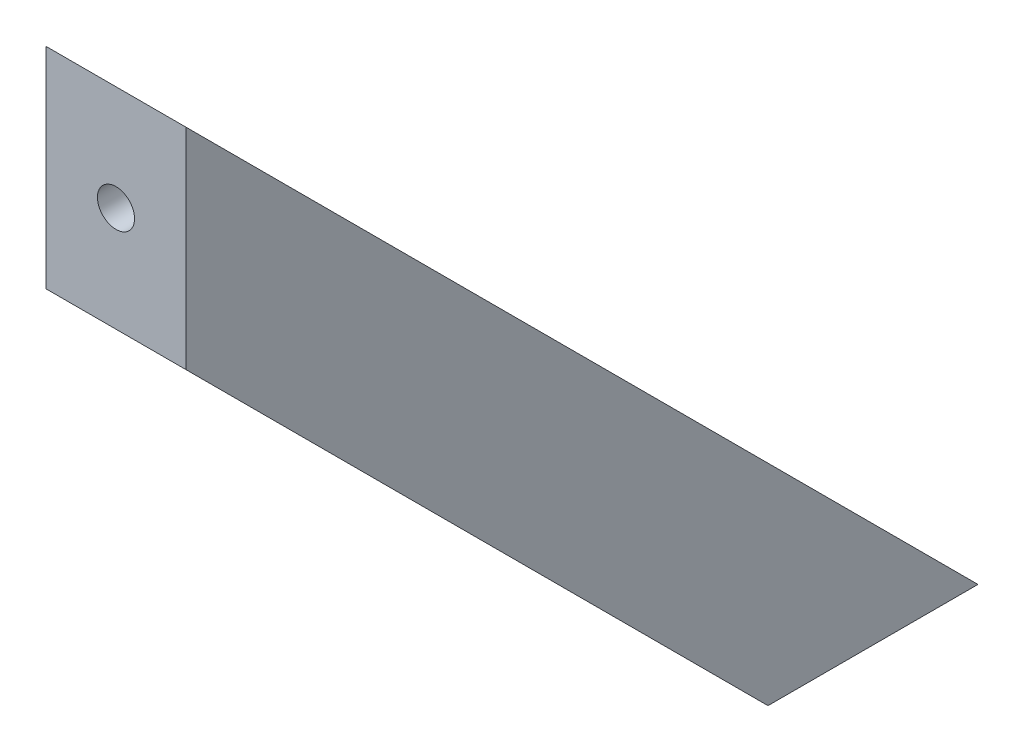
ISO-10303-21;
HEADER;
FILE_DESCRIPTION(('STEP AP214'),'2;1');
FILE_NAME('part.step','',(''),(''),'','','');
FILE_SCHEMA(('AUTOMOTIVE_DESIGN { 1 0 10303 214 1 1 1 1 }'));
ENDSEC;
DATA;
#1=APPLICATION_CONTEXT('core data for automotive mechanical design processes');
#2=APPLICATION_PROTOCOL_DEFINITION('international standard','automotive_design',2000,#1);
#3=PRODUCT_CONTEXT('',#1,'mechanical');
#4=PRODUCT('Part','Part','',(#3));
#5=PRODUCT_RELATED_PRODUCT_CATEGORY('part','',(#4));
#6=PRODUCT_DEFINITION_FORMATION('','',#4);
#7=PRODUCT_DEFINITION_CONTEXT('part definition',#1,'design');
#8=PRODUCT_DEFINITION('design','',#6,#7);
#9=PRODUCT_DEFINITION_SHAPE('','',#8);
#10=(LENGTH_UNIT() NAMED_UNIT(*) SI_UNIT(.MILLI.,.METRE.));
#11=(NAMED_UNIT(*) PLANE_ANGLE_UNIT() SI_UNIT($,.RADIAN.));
#12=(NAMED_UNIT(*) SI_UNIT($,.STERADIAN.) SOLID_ANGLE_UNIT());
#13=UNCERTAINTY_MEASURE_WITH_UNIT(LENGTH_MEASURE(1.E-05),#10,'distance_accuracy_value','');
#14=(GEOMETRIC_REPRESENTATION_CONTEXT(3) GLOBAL_UNCERTAINTY_ASSIGNED_CONTEXT((#13)) GLOBAL_UNIT_ASSIGNED_CONTEXT((#10,
#11,#12)) REPRESENTATION_CONTEXT('',''));
#15=CARTESIAN_POINT('',(0.,0.,0.));
#16=DIRECTION('',(0.,0.,1.));
#17=DIRECTION('',(1.,0.,0.));
#18=AXIS2_PLACEMENT_3D('',#15,#16,#17);
#19=CARTESIAN_POINT('',(20.,1.4137996329211E-13,-30.));
#20=DIRECTION('',(0.,1.,0.));
#21=DIRECTION('',(0.,0.,1.));
#22=AXIS2_PLACEMENT_3D('',#19,#20,#21);
#23=PLANE('',#22);
#24=CARTESIAN_POINT('',(10.,0.,-15.));
#25=DIRECTION('',(0.,-1.,0.));
#26=DIRECTION('',(0.,0.,-1.));
#27=AXIS2_PLACEMENT_3D('',#24,#25,#26);
#28=CIRCLE('',#27,2.65);
#29=CARTESIAN_POINT('',(10.,0.,-17.65));
#30=VERTEX_POINT('',#29);
#31=EDGE_CURVE('E101',#30,#30,#28,.T.);
#32=ORIENTED_EDGE('',*,*,#31,.F.);
#33=EDGE_LOOP('',(#32));
#34=FACE_BOUND('',#33,.T.);
#35=DIRECTION('',(0.,0.,-1.));
#36=VECTOR('',#35,1.);
#37=CARTESIAN_POINT('',(0.,1.4137996329211E-13,-30.));
#38=LINE('',#37,#36);
#39=CARTESIAN_POINT('',(0.,0.,0.));
#40=VERTEX_POINT('',#39);
#41=CARTESIAN_POINT('',(0.,1.4137996329211E-13,-30.));
#42=VERTEX_POINT('',#41);
#43=EDGE_CURVE('E98',#40,#42,#38,.T.);
#44=ORIENTED_EDGE('',*,*,#43,.T.);
#45=DIRECTION('',(-1.,0.,0.));
#46=VECTOR('',#45,1.);
#47=CARTESIAN_POINT('',(20.,1.4137996329211E-13,-30.));
#48=LINE('',#47,#46);
#49=CARTESIAN_POINT('',(20.,1.4137996329211E-13,-30.));
#50=VERTEX_POINT('',#49);
#51=EDGE_CURVE('E11',#50,#42,#48,.T.);
#52=ORIENTED_EDGE('',*,*,#51,.F.);
#53=DIRECTION('',(0.,0.,-1.));
#54=VECTOR('',#53,1.);
#55=CARTESIAN_POINT('',(20.,1.4137996329211E-13,-30.));
#56=LINE('',#55,#54);
#57=CARTESIAN_POINT('',(20.,0.,0.));
#58=VERTEX_POINT('',#57);
#59=EDGE_CURVE('E85',#58,#50,#56,.T.);
#60=ORIENTED_EDGE('',*,*,#59,.F.);
#61=DIRECTION('',(-1.,0.,0.));
#62=VECTOR('',#61,1.);
#63=CARTESIAN_POINT('',(20.,0.,0.));
#64=LINE('',#63,#62);
#65=EDGE_CURVE('E94',#58,#40,#64,.T.);
#66=ORIENTED_EDGE('',*,*,#65,.T.);
#67=EDGE_LOOP('',(#44,#52,#60,#66));
#68=FACE_BOUND('',#67,.T.);
#69=ADVANCED_FACE('F32',(#34,#68),#23,.F.);
#70=CARTESIAN_POINT('',(20.,113.137084989848,83.1370849898479));
#71=DIRECTION('',(0.,-0.707106781186549,0.707106781186546));
#72=DIRECTION('',(0.,-0.707106781186546,-0.707106781186549));
#73=AXIS2_PLACEMENT_3D('',#70,#71,#72);
#74=PLANE('',#73);
#75=CARTESIAN_POINT('',(10.,15.0000000000002,-14.9999999999999));
#76=DIRECTION('',(0.,-0.707106781186549,0.707106781186546));
#77=DIRECTION('',(0.,-0.707106781186546,-0.707106781186549));
#78=AXIS2_PLACEMENT_3D('',#75,#76,#77);
#79=ELLIPSE('',#78,7.77817459305204,5.5);
#80=CARTESIAN_POINT('',(10.,9.50000000000017,-20.5));
#81=VERTEX_POINT('',#80);
#82=EDGE_CURVE('E35',#81,#81,#79,.T.);
#83=ORIENTED_EDGE('',*,*,#82,.T.);
#84=EDGE_LOOP('',(#83));
#85=FACE_BOUND('',#84,.T.);
#86=CARTESIAN_POINT('',(10.,98.1370849898475,68.1370849898478));
#87=DIRECTION('',(0.,-0.707106781186549,0.707106781186546));
#88=DIRECTION('',(0.,0.707106781186546,0.707106781186549));
#89=AXIS2_PLACEMENT_3D('',#86,#87,#88);
#90=ELLIPSE('',#89,7.77817459305204,5.5);
#91=CARTESIAN_POINT('',(10.,103.637084989848,73.6370849898478));
#92=VERTEX_POINT('',#91);
#93=EDGE_CURVE('E110',#92,#92,#90,.T.);
#94=ORIENTED_EDGE('',*,*,#93,.T.);
#95=EDGE_LOOP('',(#94));
#96=FACE_BOUND('',#95,.T.);
#97=DIRECTION('',(0.,0.707106781186546,0.707106781186549));
#98=VECTOR('',#97,1.);
#99=CARTESIAN_POINT('',(0.,113.137084989848,83.1370849898479));
#100=LINE('',#99,#98);
#101=CARTESIAN_POINT('',(0.,113.137084989848,83.1370849898479));
#102=VERTEX_POINT('',#101);
#103=EDGE_CURVE('E89',#42,#102,#100,.T.);
#104=ORIENTED_EDGE('',*,*,#103,.T.);
#105=DIRECTION('',(-1.,0.,0.));
#106=VECTOR('',#105,1.);
#107=CARTESIAN_POINT('',(20.,113.137084989848,83.1370849898479));
#108=LINE('',#107,#106);
#109=CARTESIAN_POINT('',(20.,113.137084989848,83.1370849898479));
#110=VERTEX_POINT('',#109);
#111=EDGE_CURVE('E41',#110,#102,#108,.T.);
#112=ORIENTED_EDGE('',*,*,#111,.F.);
#113=DIRECTION('',(0.,0.707106781186546,0.707106781186549));
#114=VECTOR('',#113,1.);
#115=CARTESIAN_POINT('',(20.,113.137084989848,83.1370849898479));
#116=LINE('',#115,#114);
#117=EDGE_CURVE('E80',#50,#110,#116,.T.);
#118=ORIENTED_EDGE('',*,*,#117,.F.);
#119=ORIENTED_EDGE('',*,*,#51,.T.);
#120=EDGE_LOOP('',(#104,#112,#118,#119));
#121=FACE_BOUND('',#120,.T.);
#122=ADVANCED_FACE('F88',(#85,#96,#121),#74,.F.);
#123=CARTESIAN_POINT('',(20.,83.1370849898475,83.1370849898479));
#124=DIRECTION('',(0.,0.,-1.));
#125=DIRECTION('',(-1.,0.,0.));
#126=AXIS2_PLACEMENT_3D('',#123,#124,#125);
#127=PLANE('',#126);
#128=CARTESIAN_POINT('',(10.,98.1370849898475,83.1370849898479));
#129=DIRECTION('',(0.,0.,1.));
#130=DIRECTION('',(1.,0.,0.));
#131=AXIS2_PLACEMENT_3D('',#128,#129,#130);
#132=CIRCLE('',#131,2.65);
#133=CARTESIAN_POINT('',(12.65,98.1370849898475,83.1370849898479));
#134=VERTEX_POINT('',#133);
#135=EDGE_CURVE('E113',#134,#134,#132,.T.);
#136=ORIENTED_EDGE('',*,*,#135,.F.);
#137=EDGE_LOOP('',(#136));
#138=FACE_BOUND('',#137,.T.);
#139=DIRECTION('',(0.,-1.,0.));
#140=VECTOR('',#139,1.);
#141=CARTESIAN_POINT('',(0.,83.1370849898475,83.1370849898479));
#142=LINE('',#141,#140);
#143=CARTESIAN_POINT('',(0.,83.1370849898475,83.1370849898479));
#144=VERTEX_POINT('',#143);
#145=EDGE_CURVE('E67',#102,#144,#142,.T.);
#146=ORIENTED_EDGE('',*,*,#145,.T.);
#147=DIRECTION('',(-1.,0.,0.));
#148=VECTOR('',#147,1.);
#149=CARTESIAN_POINT('',(20.,83.1370849898475,83.1370849898479));
#150=LINE('',#149,#148);
#151=CARTESIAN_POINT('',(20.,83.1370849898475,83.1370849898479));
#152=VERTEX_POINT('',#151);
#153=EDGE_CURVE('E90',#152,#144,#150,.T.);
#154=ORIENTED_EDGE('',*,*,#153,.F.);
#155=DIRECTION('',(0.,-1.,0.));
#156=VECTOR('',#155,1.);
#157=CARTESIAN_POINT('',(20.,83.1370849898475,83.1370849898479));
#158=LINE('',#157,#156);
#159=EDGE_CURVE('E83',#110,#152,#158,.T.);
#160=ORIENTED_EDGE('',*,*,#159,.F.);
#161=ORIENTED_EDGE('',*,*,#111,.T.);
#162=EDGE_LOOP('',(#146,#154,#160,#161));
#163=FACE_BOUND('',#162,.T.);
#164=ADVANCED_FACE('F92',(#138,#163),#127,.F.);
#165=CARTESIAN_POINT('',(20.,0.,0.));
#166=DIRECTION('',(0.,0.707106781186549,-0.707106781186546));
#167=DIRECTION('',(0.,0.707106781186546,0.707106781186549));
#168=AXIS2_PLACEMENT_3D('',#165,#166,#167);
#169=PLANE('',#168);
#170=DIRECTION('',(0.,-0.707106781186546,-0.707106781186549));
#171=VECTOR('',#170,1.);
#172=CARTESIAN_POINT('',(0.,0.,0.));
#173=LINE('',#172,#171);
#174=EDGE_CURVE('E73',#144,#40,#173,.T.);
#175=ORIENTED_EDGE('',*,*,#174,.T.);
#176=ORIENTED_EDGE('',*,*,#65,.F.);
#177=DIRECTION('',(0.,-0.707106781186546,-0.707106781186549));
#178=VECTOR('',#177,1.);
#179=CARTESIAN_POINT('',(20.,0.,0.));
#180=LINE('',#179,#178);
#181=EDGE_CURVE('E50',#152,#58,#180,.T.);
#182=ORIENTED_EDGE('',*,*,#181,.F.);
#183=ORIENTED_EDGE('',*,*,#153,.T.);
#184=EDGE_LOOP('',(#175,#176,#182,#183));
#185=FACE_BOUND('',#184,.T.);
#186=ADVANCED_FACE('F147',(#185),#169,.F.);
#187=CARTESIAN_POINT('',(20.,0.,0.));
#188=DIRECTION('',(-1.,0.,0.));
#189=DIRECTION('',(0.,0.,1.));
#190=AXIS2_PLACEMENT_3D('',#187,#188,#189);
#191=PLANE('',#190);
#192=ORIENTED_EDGE('',*,*,#59,.T.);
#193=ORIENTED_EDGE('',*,*,#117,.T.);
#194=ORIENTED_EDGE('',*,*,#159,.T.);
#195=ORIENTED_EDGE('',*,*,#181,.T.);
#196=EDGE_LOOP('',(#192,#193,#194,#195));
#197=FACE_BOUND('',#196,.T.);
#198=ADVANCED_FACE('F81',(#197),#191,.F.);
#199=CARTESIAN_POINT('',(0.,0.,0.));
#200=DIRECTION('',(-1.,0.,0.));
#201=DIRECTION('',(0.,0.,1.));
#202=AXIS2_PLACEMENT_3D('',#199,#200,#201);
#203=PLANE('',#202);
#204=ORIENTED_EDGE('',*,*,#43,.F.);
#205=ORIENTED_EDGE('',*,*,#174,.F.);
#206=ORIENTED_EDGE('',*,*,#145,.F.);
#207=ORIENTED_EDGE('',*,*,#103,.F.);
#208=EDGE_LOOP('',(#204,#205,#206,#207));
#209=FACE_BOUND('',#208,.T.);
#210=ADVANCED_FACE('F138',(#209),#203,.T.);
#211=CARTESIAN_POINT('',(10.,113.137084989848,-14.9999999999995));
#212=DIRECTION('',(0.,-1.,0.));
#213=DIRECTION('',(0.,0.,-1.));
#214=AXIS2_PLACEMENT_3D('',#211,#212,#213);
#215=CYLINDRICAL_SURFACE('',#214,2.65);
#216=CARTESIAN_POINT('',(10.,5.00000000000007,-15.));
#217=DIRECTION('',(0.,-1.,0.));
#218=DIRECTION('',(0.,0.,-1.));
#219=AXIS2_PLACEMENT_3D('',#216,#217,#218);
#220=CIRCLE('',#219,2.65);
#221=CARTESIAN_POINT('',(10.,5.00000000000009,-17.65));
#222=VERTEX_POINT('',#221);
#223=EDGE_CURVE('E114',#222,#222,#220,.F.);
#224=ORIENTED_EDGE('',*,*,#223,.T.);
#225=EDGE_LOOP('',(#224));
#226=FACE_BOUND('',#225,.T.);
#227=ORIENTED_EDGE('',*,*,#31,.T.);
#228=EDGE_LOOP('',(#227));
#229=FACE_BOUND('',#228,.T.);
#230=ADVANCED_FACE('F132',(#226,#229),#215,.F.);
#231=CARTESIAN_POINT('',(10.,98.1370849898475,-30.));
#232=DIRECTION('',(0.,0.,1.));
#233=DIRECTION('',(1.,0.,0.));
#234=AXIS2_PLACEMENT_3D('',#231,#232,#233);
#235=CYLINDRICAL_SURFACE('',#234,2.65);
#236=CARTESIAN_POINT('',(10.,98.1370849898475,78.1370849898479));
#237=DIRECTION('',(0.,0.,1.));
#238=DIRECTION('',(1.,0.,0.));
#239=AXIS2_PLACEMENT_3D('',#236,#237,#238);
#240=CIRCLE('',#239,2.65);
#241=CARTESIAN_POINT('',(12.65,98.1370849898475,78.1370849898479));
#242=VERTEX_POINT('',#241);
#243=EDGE_CURVE('E107',#242,#242,#240,.F.);
#244=ORIENTED_EDGE('',*,*,#243,.T.);
#245=EDGE_LOOP('',(#244));
#246=FACE_BOUND('',#245,.T.);
#247=ORIENTED_EDGE('',*,*,#135,.T.);
#248=EDGE_LOOP('',(#247));
#249=FACE_BOUND('',#248,.T.);
#250=ADVANCED_FACE('F145',(#246,#249),#235,.F.);
#251=CARTESIAN_POINT('',(10.,98.1370849898475,-30.));
#252=DIRECTION('',(0.,0.,1.));
#253=DIRECTION('',(1.,0.,0.));
#254=AXIS2_PLACEMENT_3D('',#251,#252,#253);
#255=CYLINDRICAL_SURFACE('',#254,5.5);
#256=CARTESIAN_POINT('',(10.,98.1370849898475,78.1370849898479));
#257=DIRECTION('',(0.,0.,1.));
#258=DIRECTION('',(1.,0.,0.));
#259=AXIS2_PLACEMENT_3D('',#256,#257,#258);
#260=CIRCLE('',#259,5.5);
#261=CARTESIAN_POINT('',(15.5,98.1370849898475,78.1370849898479));
#262=VERTEX_POINT('',#261);
#263=EDGE_CURVE('E111',#262,#262,#260,.T.);
#264=ORIENTED_EDGE('',*,*,#263,.T.);
#265=EDGE_LOOP('',(#264));
#266=FACE_BOUND('',#265,.T.);
#267=ORIENTED_EDGE('',*,*,#93,.F.);
#268=EDGE_LOOP('',(#267));
#269=FACE_BOUND('',#268,.T.);
#270=ADVANCED_FACE('F162',(#266,#269),#255,.F.);
#271=CARTESIAN_POINT('',(10.,98.1370849898475,78.1370849898479));
#272=DIRECTION('',(0.,0.,1.));
#273=DIRECTION('',(1.,0.,0.));
#274=AXIS2_PLACEMENT_3D('',#271,#272,#273);
#275=PLANE('',#274);
#276=ORIENTED_EDGE('',*,*,#263,.F.);
#277=EDGE_LOOP('',(#276));
#278=FACE_BOUND('',#277,.T.);
#279=ORIENTED_EDGE('',*,*,#243,.F.);
#280=EDGE_LOOP('',(#279));
#281=FACE_BOUND('',#280,.T.);
#282=ADVANCED_FACE('F164',(#278,#281),#275,.F.);
#283=CARTESIAN_POINT('',(10.,113.137084989848,-14.9999999999995));
#284=DIRECTION('',(0.,-1.,0.));
#285=DIRECTION('',(0.,0.,-1.));
#286=AXIS2_PLACEMENT_3D('',#283,#284,#285);
#287=CYLINDRICAL_SURFACE('',#286,5.5);
#288=CARTESIAN_POINT('',(10.,5.00000000000007,-15.));
#289=DIRECTION('',(0.,-1.,0.));
#290=DIRECTION('',(0.,0.,-1.));
#291=AXIS2_PLACEMENT_3D('',#288,#289,#290);
#292=CIRCLE('',#291,5.5);
#293=CARTESIAN_POINT('',(10.,5.0000000000001,-20.5));
#294=VERTEX_POINT('',#293);
#295=EDGE_CURVE('E116',#294,#294,#292,.T.);
#296=ORIENTED_EDGE('',*,*,#295,.T.);
#297=EDGE_LOOP('',(#296));
#298=FACE_BOUND('',#297,.T.);
#299=ORIENTED_EDGE('',*,*,#82,.F.);
#300=EDGE_LOOP('',(#299));
#301=FACE_BOUND('',#300,.T.);
#302=ADVANCED_FACE('F171',(#298,#301),#287,.F.);
#303=CARTESIAN_POINT('',(10.,5.00000000000007,-15.));
#304=DIRECTION('',(0.,-1.,0.));
#305=DIRECTION('',(0.,0.,-1.));
#306=AXIS2_PLACEMENT_3D('',#303,#304,#305);
#307=PLANE('',#306);
#308=ORIENTED_EDGE('',*,*,#295,.F.);
#309=EDGE_LOOP('',(#308));
#310=FACE_BOUND('',#309,.T.);
#311=ORIENTED_EDGE('',*,*,#223,.F.);
#312=EDGE_LOOP('',(#311));
#313=FACE_BOUND('',#312,.T.);
#314=ADVANCED_FACE('F179',(#310,#313),#307,.F.);
#315=CLOSED_SHELL('',(#69,#122,#164,#186,#198,#210,#230,#250,#270,#282,#302,#314));
#316=MANIFOLD_SOLID_BREP('B2',#315);
#317=ADVANCED_BREP_SHAPE_REPRESENTATION('',(#18,#316),#14);
#318=SHAPE_DEFINITION_REPRESENTATION(#9,#317);
ENDSEC;
END-ISO-10303-21;
